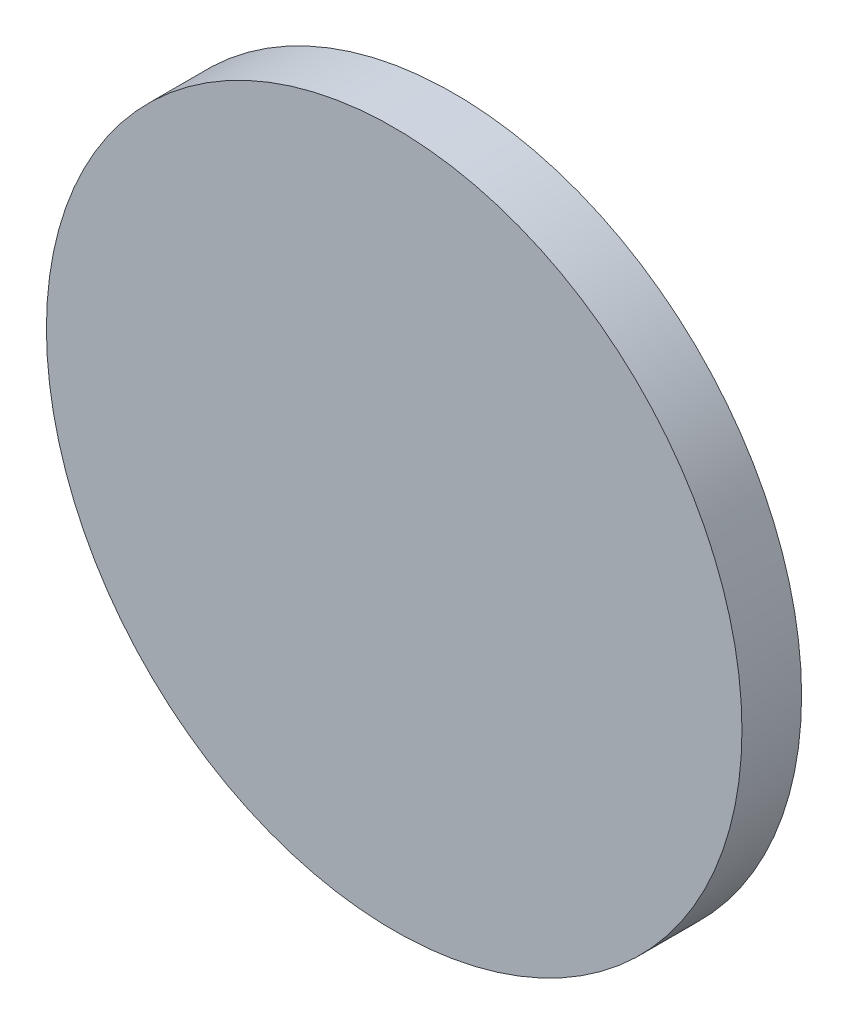
ISO-10303-21;
HEADER;
FILE_DESCRIPTION(('STEP AP214'),'2;1');
FILE_NAME('part.step','',(''),(''),'','','');
FILE_SCHEMA(('AUTOMOTIVE_DESIGN { 1 0 10303 214 1 1 1 1 }'));
ENDSEC;
DATA;
#1=APPLICATION_CONTEXT('core data for automotive mechanical design processes');
#2=APPLICATION_PROTOCOL_DEFINITION('international standard','automotive_design',2000,#1);
#3=PRODUCT_CONTEXT('',#1,'mechanical');
#4=PRODUCT('Part','Part','',(#3));
#5=PRODUCT_RELATED_PRODUCT_CATEGORY('part','',(#4));
#6=PRODUCT_DEFINITION_FORMATION('','',#4);
#7=PRODUCT_DEFINITION_CONTEXT('part definition',#1,'design');
#8=PRODUCT_DEFINITION('design','',#6,#7);
#9=PRODUCT_DEFINITION_SHAPE('','',#8);
#10=(LENGTH_UNIT() NAMED_UNIT(*) SI_UNIT(.MILLI.,.METRE.));
#11=(NAMED_UNIT(*) PLANE_ANGLE_UNIT() SI_UNIT($,.RADIAN.));
#12=(NAMED_UNIT(*) SI_UNIT($,.STERADIAN.) SOLID_ANGLE_UNIT());
#13=UNCERTAINTY_MEASURE_WITH_UNIT(LENGTH_MEASURE(1.E-05),#10,'distance_accuracy_value','');
#14=(GEOMETRIC_REPRESENTATION_CONTEXT(3) GLOBAL_UNCERTAINTY_ASSIGNED_CONTEXT((#13)) GLOBAL_UNIT_ASSIGNED_CONTEXT((#10,
#11,#12)) REPRESENTATION_CONTEXT('',''));
#15=CARTESIAN_POINT('',(0.,0.,0.));
#16=DIRECTION('',(0.,0.,1.));
#17=DIRECTION('',(1.,0.,0.));
#18=AXIS2_PLACEMENT_3D('',#15,#16,#17);
#19=CARTESIAN_POINT('',(10.629,4.339000014875,0.79916));
#20=DIRECTION('',(0.,0.,1.));
#21=DIRECTION('',(1.,0.,0.));
#22=AXIS2_PLACEMENT_3D('',#19,#20,#21);
#23=PLANE('',#22);
#24=CARTESIAN_POINT('',(10.629,4.339000014875,0.79916));
#25=DIRECTION('',(0.,0.,1.));
#26=DIRECTION('',(1.,0.,0.));
#27=AXIS2_PLACEMENT_3D('',#24,#25,#26);
#28=CIRCLE('',#27,0.200024667);
#29=CARTESIAN_POINT('',(10.829024667,4.339000014875,0.79916));
#30=VERTEX_POINT('',#29);
#31=EDGE_CURVE('E18',#30,#30,#28,.F.);
#32=ORIENTED_EDGE('',*,*,#31,.F.);
#33=EDGE_LOOP('',(#32));
#34=FACE_BOUND('',#33,.T.);
#35=ADVANCED_FACE('F15',(#34),#23,.T.);
#36=CARTESIAN_POINT('',(10.629,4.339000014875,0.76487));
#37=DIRECTION('',(0.,0.,1.));
#38=DIRECTION('',(1.,0.,0.));
#39=AXIS2_PLACEMENT_3D('',#36,#37,#38);
#40=CYLINDRICAL_SURFACE('',#39,0.200024667);
#41=ORIENTED_EDGE('',*,*,#31,.T.);
#42=EDGE_LOOP('',(#41));
#43=FACE_BOUND('',#42,.T.);
#44=CARTESIAN_POINT('',(10.629,4.339000014875,0.76487));
#45=DIRECTION('',(0.,0.,1.));
#46=DIRECTION('',(1.,0.,0.));
#47=AXIS2_PLACEMENT_3D('',#44,#45,#46);
#48=CIRCLE('',#47,0.200024667);
#49=CARTESIAN_POINT('',(10.829024667,4.339000014875,0.76487));
#50=VERTEX_POINT('',#49);
#51=EDGE_CURVE('E10',#50,#50,#48,.F.);
#52=ORIENTED_EDGE('',*,*,#51,.F.);
#53=EDGE_LOOP('',(#52));
#54=FACE_BOUND('',#53,.T.);
#55=ADVANCED_FACE('F27',(#43,#54),#40,.T.);
#56=CARTESIAN_POINT('',(10.629,4.339000014875,0.76487));
#57=DIRECTION('',(0.,0.,-1.));
#58=DIRECTION('',(-1.,0.,0.));
#59=AXIS2_PLACEMENT_3D('',#56,#57,#58);
#60=PLANE('',#59);
#61=ORIENTED_EDGE('',*,*,#51,.T.);
#62=EDGE_LOOP('',(#61));
#63=FACE_BOUND('',#62,.T.);
#64=ADVANCED_FACE('F35',(#63),#60,.T.);
#65=CLOSED_SHELL('',(#35,#55,#64));
#66=MANIFOLD_SOLID_BREP('B1',#65);
#67=ADVANCED_BREP_SHAPE_REPRESENTATION('',(#18,#66),#14);
#68=SHAPE_DEFINITION_REPRESENTATION(#9,#67);
ENDSEC;
END-ISO-10303-21;
